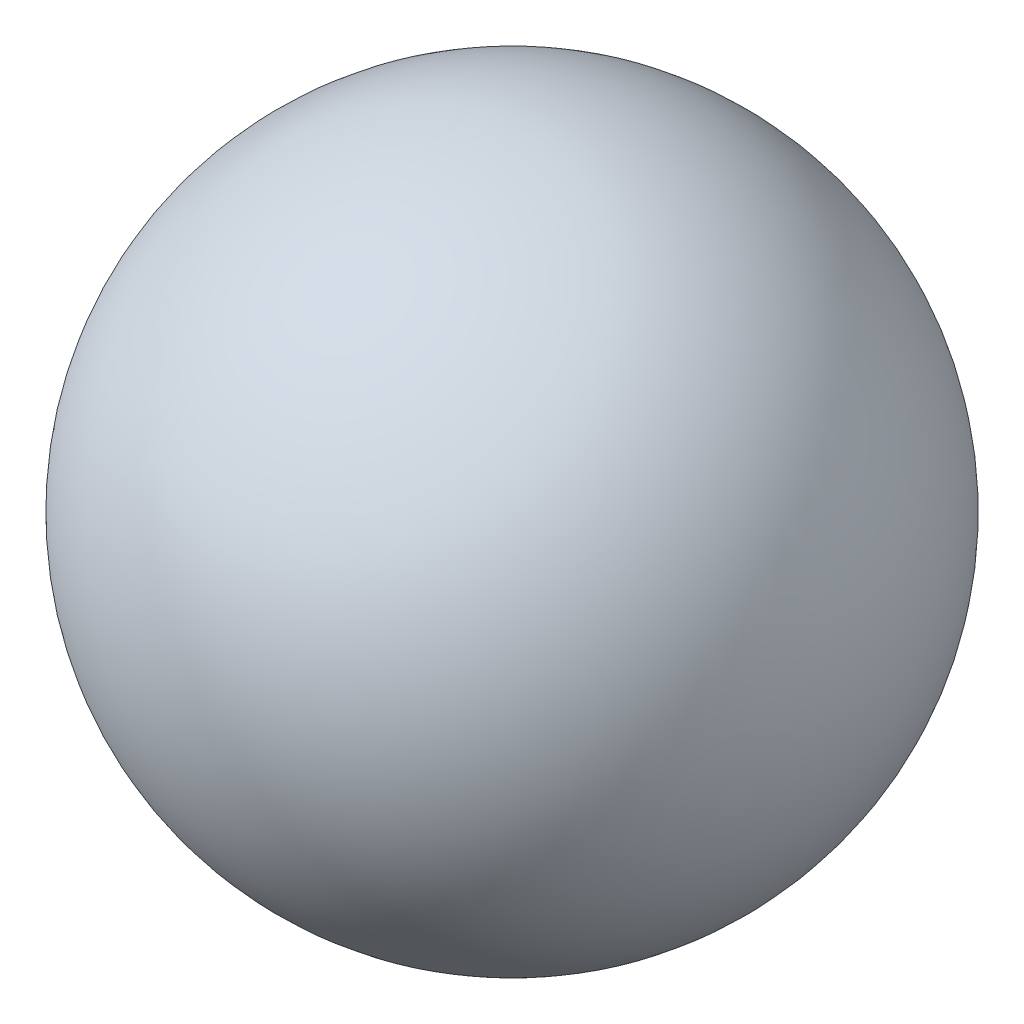
ISO-10303-21;
HEADER;
FILE_DESCRIPTION(('STEP AP214'),'2;1');
FILE_NAME('part.step','',(''),(''),'','','');
FILE_SCHEMA(('AUTOMOTIVE_DESIGN { 1 0 10303 214 1 1 1 1 }'));
ENDSEC;
DATA;
#1=APPLICATION_CONTEXT('core data for automotive mechanical design processes');
#2=APPLICATION_PROTOCOL_DEFINITION('international standard','automotive_design',2000,#1);
#3=PRODUCT_CONTEXT('',#1,'mechanical');
#4=PRODUCT('Part','Part','',(#3));
#5=PRODUCT_RELATED_PRODUCT_CATEGORY('part','',(#4));
#6=PRODUCT_DEFINITION_FORMATION('','',#4);
#7=PRODUCT_DEFINITION_CONTEXT('part definition',#1,'design');
#8=PRODUCT_DEFINITION('design','',#6,#7);
#9=PRODUCT_DEFINITION_SHAPE('','',#8);
#10=(LENGTH_UNIT() NAMED_UNIT(*) SI_UNIT(.MILLI.,.METRE.));
#11=(NAMED_UNIT(*) PLANE_ANGLE_UNIT() SI_UNIT($,.RADIAN.));
#12=(NAMED_UNIT(*) SI_UNIT($,.STERADIAN.) SOLID_ANGLE_UNIT());
#13=UNCERTAINTY_MEASURE_WITH_UNIT(LENGTH_MEASURE(1.E-05),#10,'distance_accuracy_value','');
#14=(GEOMETRIC_REPRESENTATION_CONTEXT(3) GLOBAL_UNCERTAINTY_ASSIGNED_CONTEXT((#13)) GLOBAL_UNIT_ASSIGNED_CONTEXT((#10,
#11,#12)) REPRESENTATION_CONTEXT('',''));
#15=CARTESIAN_POINT('',(0.,0.,0.));
#16=DIRECTION('',(0.,0.,1.));
#17=DIRECTION('',(1.,0.,0.));
#18=AXIS2_PLACEMENT_3D('',#15,#16,#17);
#19=CARTESIAN_POINT('',(0.,0.,0.));
#20=DIRECTION('',(0.,1.,0.));
#21=DIRECTION('',(1.,0.,0.));
#22=AXIS2_PLACEMENT_3D('',#19,#20,#21);
#23=SPHERICAL_SURFACE('',#22,150.);
#24=CARTESIAN_POINT('',(0.,150.,0.));
#25=VERTEX_POINT('',#24);
#26=VERTEX_LOOP('',#25);
#27=FACE_BOUND('',#26,.T.);
#28=ADVANCED_FACE('F29',(#27),#23,.T.);
#29=CLOSED_SHELL('',(#28));
#30=MANIFOLD_SOLID_BREP('B2',#29);
#31=ADVANCED_BREP_SHAPE_REPRESENTATION('',(#18,#30),#14);
#32=SHAPE_DEFINITION_REPRESENTATION(#9,#31);
ENDSEC;
END-ISO-10303-21;
